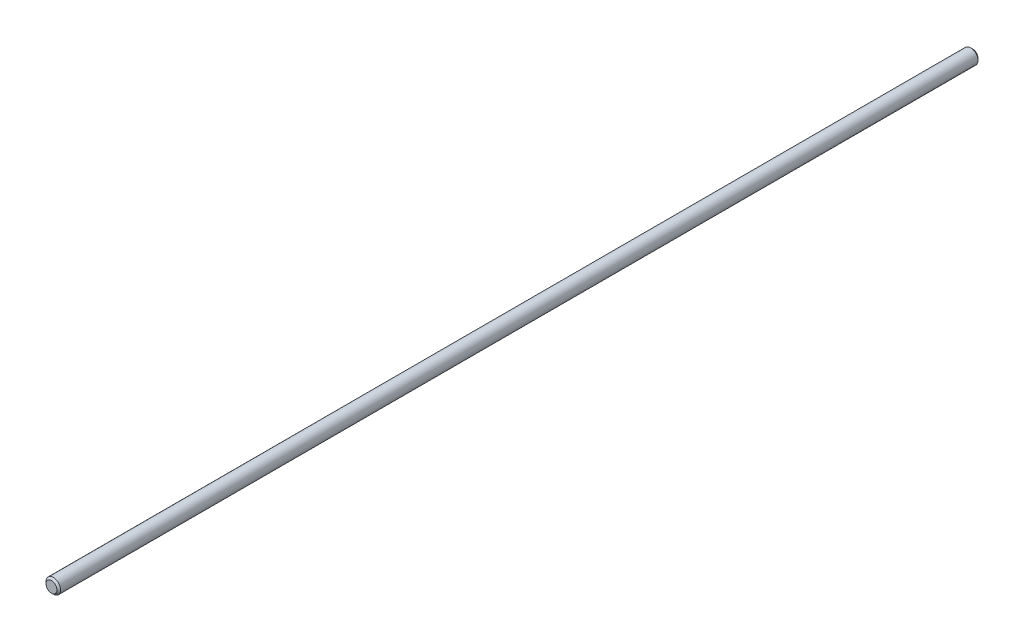
ISO-10303-21;
HEADER;
FILE_DESCRIPTION(('STEP AP214'),'2;1');
FILE_NAME('part.step','',(''),(''),'','','');
FILE_SCHEMA(('AUTOMOTIVE_DESIGN { 1 0 10303 214 1 1 1 1 }'));
ENDSEC;
DATA;
#1=APPLICATION_CONTEXT('core data for automotive mechanical design processes');
#2=APPLICATION_PROTOCOL_DEFINITION('international standard','automotive_design',2000,#1);
#3=PRODUCT_CONTEXT('',#1,'mechanical');
#4=PRODUCT('Part','Part','',(#3));
#5=PRODUCT_RELATED_PRODUCT_CATEGORY('part','',(#4));
#6=PRODUCT_DEFINITION_FORMATION('','',#4);
#7=PRODUCT_DEFINITION_CONTEXT('part definition',#1,'design');
#8=PRODUCT_DEFINITION('design','',#6,#7);
#9=PRODUCT_DEFINITION_SHAPE('','',#8);
#10=(LENGTH_UNIT() NAMED_UNIT(*) SI_UNIT(.MILLI.,.METRE.));
#11=(NAMED_UNIT(*) PLANE_ANGLE_UNIT() SI_UNIT($,.RADIAN.));
#12=(NAMED_UNIT(*) SI_UNIT($,.STERADIAN.) SOLID_ANGLE_UNIT());
#13=UNCERTAINTY_MEASURE_WITH_UNIT(LENGTH_MEASURE(1.E-05),#10,'distance_accuracy_value','');
#14=(GEOMETRIC_REPRESENTATION_CONTEXT(3) GLOBAL_UNCERTAINTY_ASSIGNED_CONTEXT((#13)) GLOBAL_UNIT_ASSIGNED_CONTEXT((#10,
#11,#12)) REPRESENTATION_CONTEXT('',''));
#15=CARTESIAN_POINT('',(0.,0.,0.));
#16=DIRECTION('',(0.,0.,1.));
#17=DIRECTION('',(1.,0.,0.));
#18=AXIS2_PLACEMENT_3D('',#15,#16,#17);
#19=CARTESIAN_POINT('',(0.,0.,505.));
#20=DIRECTION('',(0.,0.,-1.));
#21=DIRECTION('',(-1.,0.,0.));
#22=AXIS2_PLACEMENT_3D('',#19,#20,#21);
#23=CYLINDRICAL_SURFACE('',#22,4.);
#24=CARTESIAN_POINT('',(0.,0.,1.));
#25=DIRECTION('',(0.,0.,1.));
#26=DIRECTION('',(1.,0.,0.));
#27=AXIS2_PLACEMENT_3D('',#24,#25,#26);
#28=CIRCLE('',#27,4.);
#29=CARTESIAN_POINT('',(4.,0.,1.));
#30=VERTEX_POINT('',#29);
#31=EDGE_CURVE('E47',#30,#30,#28,.T.);
#32=ORIENTED_EDGE('',*,*,#31,.T.);
#33=EDGE_LOOP('',(#32));
#34=FACE_BOUND('',#33,.T.);
#35=CARTESIAN_POINT('',(0.,0.,504.));
#36=DIRECTION('',(0.,0.,1.));
#37=DIRECTION('',(1.,0.,0.));
#38=AXIS2_PLACEMENT_3D('',#35,#36,#37);
#39=CIRCLE('',#38,4.);
#40=CARTESIAN_POINT('',(4.,0.,504.));
#41=VERTEX_POINT('',#40);
#42=EDGE_CURVE('E51',#41,#41,#39,.F.);
#43=ORIENTED_EDGE('',*,*,#42,.T.);
#44=EDGE_LOOP('',(#43));
#45=FACE_BOUND('',#44,.T.);
#46=ADVANCED_FACE('F36',(#34,#45),#23,.T.);
#47=CARTESIAN_POINT('',(0.,0.,505.));
#48=DIRECTION('',(0.,0.,1.));
#49=DIRECTION('',(1.,0.,0.));
#50=AXIS2_PLACEMENT_3D('',#47,#48,#49);
#51=PLANE('',#50);
#52=CARTESIAN_POINT('',(0.,0.,505.));
#53=DIRECTION('',(0.,0.,1.));
#54=DIRECTION('',(1.,0.,0.));
#55=AXIS2_PLACEMENT_3D('',#52,#53,#54);
#56=CIRCLE('',#55,3.00000000000006);
#57=CARTESIAN_POINT('',(3.00000000000006,0.,505.));
#58=VERTEX_POINT('',#57);
#59=EDGE_CURVE('E10',#58,#58,#56,.T.);
#60=ORIENTED_EDGE('',*,*,#59,.T.);
#61=EDGE_LOOP('',(#60));
#62=FACE_BOUND('',#61,.T.);
#63=ADVANCED_FACE('F67',(#62),#51,.T.);
#64=CARTESIAN_POINT('',(0.,0.,0.));
#65=DIRECTION('',(0.,0.,1.));
#66=DIRECTION('',(1.,0.,0.));
#67=AXIS2_PLACEMENT_3D('',#64,#65,#66);
#68=PLANE('',#67);
#69=CARTESIAN_POINT('',(0.,0.,0.));
#70=DIRECTION('',(0.,0.,1.));
#71=DIRECTION('',(1.,0.,0.));
#72=AXIS2_PLACEMENT_3D('',#69,#70,#71);
#73=CIRCLE('',#72,2.99999999999995);
#74=CARTESIAN_POINT('',(2.99999999999995,0.,0.));
#75=VERTEX_POINT('',#74);
#76=EDGE_CURVE('E43',#75,#75,#73,.F.);
#77=ORIENTED_EDGE('',*,*,#76,.T.);
#78=EDGE_LOOP('',(#77));
#79=FACE_BOUND('',#78,.T.);
#80=ADVANCED_FACE('F64',(#79),#68,.F.);
#81=CARTESIAN_POINT('',(0.,0.,1.));
#82=DIRECTION('',(0.,0.,1.));
#83=DIRECTION('',(1.,0.,0.));
#84=AXIS2_PLACEMENT_3D('',#81,#82,#83);
#85=CONICAL_SURFACE('',#84,4.,0.785398163397474);
#86=ORIENTED_EDGE('',*,*,#76,.F.);
#87=EDGE_LOOP('',(#86));
#88=FACE_BOUND('',#87,.T.);
#89=ORIENTED_EDGE('',*,*,#31,.F.);
#90=EDGE_LOOP('',(#89));
#91=FACE_BOUND('',#90,.T.);
#92=ADVANCED_FACE('F60',(#88,#91),#85,.T.);
#93=CARTESIAN_POINT('',(0.,0.,505.));
#94=DIRECTION('',(0.,0.,-1.));
#95=DIRECTION('',(-1.,0.,0.));
#96=AXIS2_PLACEMENT_3D('',#93,#94,#95);
#97=CONICAL_SURFACE('',#96,3.00000000000006,0.785398163397363);
#98=ORIENTED_EDGE('',*,*,#42,.F.);
#99=EDGE_LOOP('',(#98));
#100=FACE_BOUND('',#99,.T.);
#101=ORIENTED_EDGE('',*,*,#59,.F.);
#102=EDGE_LOOP('',(#101));
#103=FACE_BOUND('',#102,.T.);
#104=ADVANCED_FACE('F38',(#100,#103),#97,.T.);
#105=CLOSED_SHELL('',(#46,#63,#80,#92,#104));
#106=MANIFOLD_SOLID_BREP('B2',#105);
#107=ADVANCED_BREP_SHAPE_REPRESENTATION('',(#18,#106),#14);
#108=SHAPE_DEFINITION_REPRESENTATION(#9,#107);
ENDSEC;
END-ISO-10303-21;
